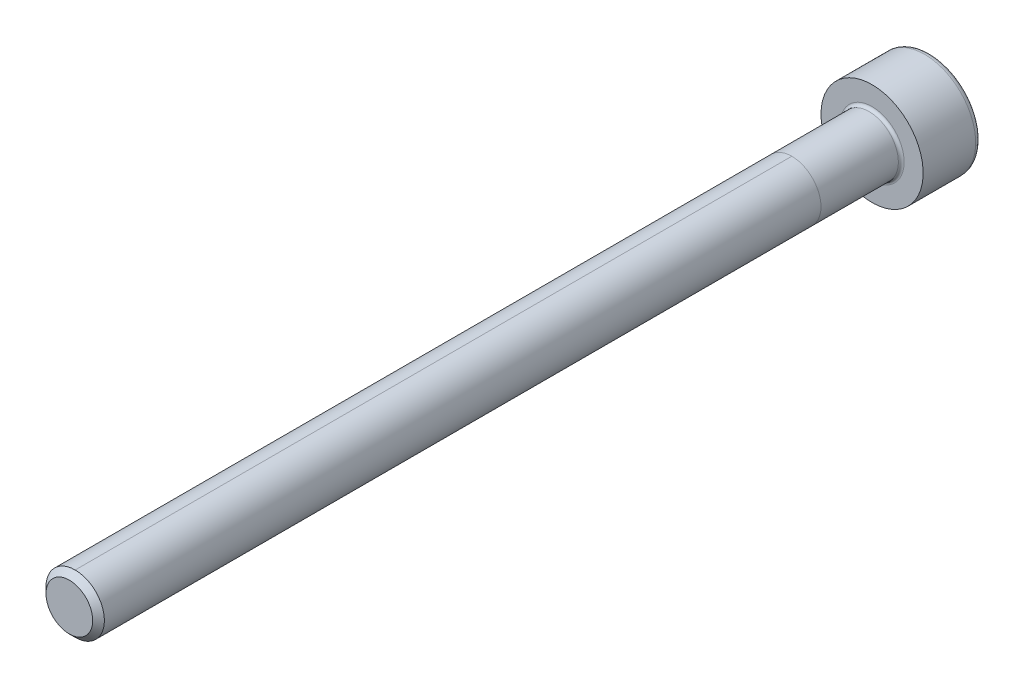
ISO-10303-21;
HEADER;
FILE_DESCRIPTION(('STEP AP214'),'2;1');
FILE_NAME('part.step','',(''),(''),'','','');
FILE_SCHEMA(('AUTOMOTIVE_DESIGN { 1 0 10303 214 1 1 1 1 }'));
ENDSEC;
DATA;
#1=APPLICATION_CONTEXT('core data for automotive mechanical design processes');
#2=APPLICATION_PROTOCOL_DEFINITION('international standard','automotive_design',2000,#1);
#3=PRODUCT_CONTEXT('',#1,'mechanical');
#4=PRODUCT('Part','Part','',(#3));
#5=PRODUCT_RELATED_PRODUCT_CATEGORY('part','',(#4));
#6=PRODUCT_DEFINITION_FORMATION('','',#4);
#7=PRODUCT_DEFINITION_CONTEXT('part definition',#1,'design');
#8=PRODUCT_DEFINITION('design','',#6,#7);
#9=PRODUCT_DEFINITION_SHAPE('','',#8);
#10=(LENGTH_UNIT() NAMED_UNIT(*) SI_UNIT(.MILLI.,.METRE.));
#11=(NAMED_UNIT(*) PLANE_ANGLE_UNIT() SI_UNIT($,.RADIAN.));
#12=(NAMED_UNIT(*) SI_UNIT($,.STERADIAN.) SOLID_ANGLE_UNIT());
#13=UNCERTAINTY_MEASURE_WITH_UNIT(LENGTH_MEASURE(1.E-05),#10,'distance_accuracy_value','');
#14=(GEOMETRIC_REPRESENTATION_CONTEXT(3) GLOBAL_UNCERTAINTY_ASSIGNED_CONTEXT((#13)) GLOBAL_UNIT_ASSIGNED_CONTEXT((#10,
#11,#12)) REPRESENTATION_CONTEXT('',''));
#15=CARTESIAN_POINT('',(0.,0.,0.));
#16=DIRECTION('',(0.,0.,1.));
#17=DIRECTION('',(1.,0.,0.));
#18=AXIS2_PLACEMENT_3D('',#15,#16,#17);
#19=CARTESIAN_POINT('',(0.,0.,55.));
#20=DIRECTION('',(0.,0.,-1.));
#21=DIRECTION('',(-1.,0.,0.));
#22=AXIS2_PLACEMENT_3D('',#19,#20,#21);
#23=CYLINDRICAL_SURFACE('',#22,2.);
#24=DIRECTION('',(0.,0.,-1.));
#25=VECTOR('',#24,1.);
#26=CARTESIAN_POINT('',(0.,2.,55.));
#27=LINE('',#26,#25);
#28=CARTESIAN_POINT('',(0.,2.,54.6));
#29=VERTEX_POINT('',#28);
#30=CARTESIAN_POINT('',(0.,2.,5.5));
#31=VERTEX_POINT('',#30);
#32=EDGE_CURVE('E58',#29,#31,#27,.T.);
#33=ORIENTED_EDGE('',*,*,#32,.F.);
#34=CARTESIAN_POINT('',(0.,0.,54.6));
#35=DIRECTION('',(0.,0.,1.));
#36=DIRECTION('',(1.,0.,0.));
#37=AXIS2_PLACEMENT_3D('',#34,#35,#36);
#38=CIRCLE('',#37,2.);
#39=CARTESIAN_POINT('',(0.,-2.,54.6));
#40=VERTEX_POINT('',#39);
#41=EDGE_CURVE('E192',#29,#40,#38,.F.);
#42=ORIENTED_EDGE('',*,*,#41,.T.);
#43=DIRECTION('',(0.,0.,-1.));
#44=VECTOR('',#43,1.);
#45=CARTESIAN_POINT('',(0.,-2.00000000000001,55.));
#46=LINE('',#45,#44);
#47=CARTESIAN_POINT('',(0.,-2.00000000000001,5.5));
#48=VERTEX_POINT('',#47);
#49=EDGE_CURVE('E195',#40,#48,#46,.T.);
#50=ORIENTED_EDGE('',*,*,#49,.T.);
#51=CARTESIAN_POINT('',(0.,0.,5.5));
#52=DIRECTION('',(0.,0.,1.));
#53=DIRECTION('',(0.,-1.,0.));
#54=AXIS2_PLACEMENT_3D('',#51,#52,#53);
#55=CIRCLE('',#54,2.);
#56=EDGE_CURVE('E64',#48,#31,#55,.T.);
#57=ORIENTED_EDGE('',*,*,#56,.T.);
#58=EDGE_LOOP('',(#33,#42,#50,#57));
#59=FACE_BOUND('',#58,.T.);
#60=ADVANCED_FACE('F43',(#59),#23,.T.);
#61=CARTESIAN_POINT('',(0.,0.,0.199999999999999));
#62=DIRECTION('',(0.,0.,-1.));
#63=DIRECTION('',(-1.,0.,0.));
#64=AXIS2_PLACEMENT_3D('',#61,#62,#63);
#65=CIRCLE('',#64,2.);
#66=CARTESIAN_POINT('',(-2.,0.,0.199999999999999));
#67=VERTEX_POINT('',#66);
#68=EDGE_CURVE('E12',#67,#67,#65,.F.);
#69=ORIENTED_EDGE('',*,*,#68,.T.);
#70=EDGE_LOOP('',(#69));
#71=FACE_BOUND('',#70,.T.);
#72=ORIENTED_EDGE('',*,*,#56,.F.);
#73=EDGE_CURVE('E217',#31,#48,#55,.T.);
#74=ORIENTED_EDGE('',*,*,#73,.F.);
#75=EDGE_LOOP('',(#72,#74));
#76=FACE_BOUND('',#75,.T.);
#77=ADVANCED_FACE('F235',(#71,#76),#23,.T.);
#78=EDGE_CURVE('E193',#40,#29,#38,.F.);
#79=ORIENTED_EDGE('',*,*,#78,.T.);
#80=ORIENTED_EDGE('',*,*,#32,.T.);
#81=ORIENTED_EDGE('',*,*,#73,.T.);
#82=ORIENTED_EDGE('',*,*,#49,.F.);
#83=EDGE_LOOP('',(#79,#80,#81,#82));
#84=FACE_BOUND('',#83,.T.);
#85=ADVANCED_FACE('F238',(#84),#23,.T.);
#86=CARTESIAN_POINT('',(0.,0.,55.));
#87=DIRECTION('',(0.,0.,1.));
#88=DIRECTION('',(1.,0.,0.));
#89=AXIS2_PLACEMENT_3D('',#86,#87,#88);
#90=PLANE('',#89);
#91=CARTESIAN_POINT('',(0.,0.,55.));
#92=DIRECTION('',(0.,0.,1.));
#93=DIRECTION('',(1.,0.,0.));
#94=AXIS2_PLACEMENT_3D('',#91,#92,#93);
#95=CIRCLE('',#94,1.60000000000002);
#96=CARTESIAN_POINT('',(1.60000000000002,0.,55.));
#97=VERTEX_POINT('',#96);
#98=EDGE_CURVE('E189',#97,#97,#95,.T.);
#99=ORIENTED_EDGE('',*,*,#98,.T.);
#100=EDGE_LOOP('',(#99));
#101=FACE_BOUND('',#100,.T.);
#102=ADVANCED_FACE('F246',(#101),#90,.T.);
#103=CARTESIAN_POINT('',(0.,0.,0.));
#104=DIRECTION('',(0.,0.,-1.));
#105=DIRECTION('',(-1.,0.,0.));
#106=AXIS2_PLACEMENT_3D('',#103,#104,#105);
#107=PLANE('',#106);
#108=CARTESIAN_POINT('',(0.,0.,0.));
#109=DIRECTION('',(0.,0.,-1.));
#110=DIRECTION('',(-1.,0.,0.));
#111=AXIS2_PLACEMENT_3D('',#108,#109,#110);
#112=CIRCLE('',#111,2.2);
#113=CARTESIAN_POINT('',(-2.2,0.,0.));
#114=VERTEX_POINT('',#113);
#115=EDGE_CURVE('E51',#114,#114,#112,.T.);
#116=ORIENTED_EDGE('',*,*,#115,.T.);
#117=EDGE_LOOP('',(#116));
#118=FACE_BOUND('',#117,.T.);
#119=CARTESIAN_POINT('',(0.,0.,0.));
#120=DIRECTION('',(0.,0.,-1.));
#121=DIRECTION('',(-1.,0.,0.));
#122=AXIS2_PLACEMENT_3D('',#119,#120,#121);
#123=CIRCLE('',#122,3.5);
#124=CARTESIAN_POINT('',(-3.5,0.,0.));
#125=VERTEX_POINT('',#124);
#126=EDGE_CURVE('E179',#125,#125,#123,.T.);
#127=ORIENTED_EDGE('',*,*,#126,.F.);
#128=EDGE_LOOP('',(#127));
#129=FACE_BOUND('',#128,.T.);
#130=ADVANCED_FACE('F224',(#118,#129),#107,.F.);
#131=CARTESIAN_POINT('',(0.,0.,-4.));
#132=DIRECTION('',(0.,0.,1.));
#133=DIRECTION('',(1.,0.,0.));
#134=AXIS2_PLACEMENT_3D('',#131,#132,#133);
#135=CYLINDRICAL_SURFACE('',#134,3.5);
#136=CARTESIAN_POINT('',(0.,0.,-3.6));
#137=DIRECTION('',(0.,0.,-1.));
#138=DIRECTION('',(-1.,0.,0.));
#139=AXIS2_PLACEMENT_3D('',#136,#137,#138);
#140=CIRCLE('',#139,3.5);
#141=CARTESIAN_POINT('',(-3.5,0.,-3.6));
#142=VERTEX_POINT('',#141);
#143=EDGE_CURVE('E186',#142,#142,#140,.F.);
#144=ORIENTED_EDGE('',*,*,#143,.T.);
#145=EDGE_LOOP('',(#144));
#146=FACE_BOUND('',#145,.T.);
#147=ORIENTED_EDGE('',*,*,#126,.T.);
#148=EDGE_LOOP('',(#147));
#149=FACE_BOUND('',#148,.T.);
#150=ADVANCED_FACE('F282',(#146,#149),#135,.T.);
#151=CARTESIAN_POINT('',(0.,0.,-4.));
#152=DIRECTION('',(0.,0.,-1.));
#153=DIRECTION('',(-1.,0.,0.));
#154=AXIS2_PLACEMENT_3D('',#151,#152,#153);
#155=PLANE('',#154);
#156=DIRECTION('',(0.499999999999998,-0.866025403784439,0.));
#157=VECTOR('',#156,1.);
#158=CARTESIAN_POINT('',(0.866025403784439,1.5,-4.));
#159=LINE('',#158,#157);
#160=CARTESIAN_POINT('',(0.866025403784439,1.5,-4.));
#161=VERTEX_POINT('',#160);
#162=CARTESIAN_POINT('',(1.73205080756888,0.,-4.));
#163=VERTEX_POINT('',#162);
#164=EDGE_CURVE('E122',#161,#163,#159,.T.);
#165=ORIENTED_EDGE('',*,*,#164,.F.);
#166=DIRECTION('',(1.,0.,0.));
#167=VECTOR('',#166,1.);
#168=CARTESIAN_POINT('',(-0.866025403784446,1.5,-4.));
#169=LINE('',#168,#167);
#170=CARTESIAN_POINT('',(-0.866025403784446,1.5,-4.));
#171=VERTEX_POINT('',#170);
#172=EDGE_CURVE('E176',#171,#161,#169,.T.);
#173=ORIENTED_EDGE('',*,*,#172,.F.);
#174=DIRECTION('',(0.5,0.866025403784439,0.));
#175=VECTOR('',#174,1.);
#176=CARTESIAN_POINT('',(-1.73205080756888,0.,-4.));
#177=LINE('',#176,#175);
#178=CARTESIAN_POINT('',(-1.73205080756888,0.,-4.));
#179=VERTEX_POINT('',#178);
#180=EDGE_CURVE('E173',#179,#171,#177,.T.);
#181=ORIENTED_EDGE('',*,*,#180,.F.);
#182=DIRECTION('',(-0.5,0.866025403784439,0.));
#183=VECTOR('',#182,1.);
#184=CARTESIAN_POINT('',(-0.866025403784443,-1.5,-4.));
#185=LINE('',#184,#183);
#186=CARTESIAN_POINT('',(-0.866025403784443,-1.5,-4.));
#187=VERTEX_POINT('',#186);
#188=EDGE_CURVE('E170',#187,#179,#185,.T.);
#189=ORIENTED_EDGE('',*,*,#188,.F.);
#190=DIRECTION('',(-1.,0.,0.));
#191=VECTOR('',#190,1.);
#192=CARTESIAN_POINT('',(0.866025403784436,-1.5,-4.));
#193=LINE('',#192,#191);
#194=CARTESIAN_POINT('',(0.866025403784436,-1.5,-4.));
#195=VERTEX_POINT('',#194);
#196=EDGE_CURVE('E167',#195,#187,#193,.T.);
#197=ORIENTED_EDGE('',*,*,#196,.F.);
#198=DIRECTION('',(-0.500000000000001,-0.866025403784438,0.));
#199=VECTOR('',#198,1.);
#200=CARTESIAN_POINT('',(1.73205080756888,0.,-4.));
#201=LINE('',#200,#199);
#202=EDGE_CURVE('E164',#163,#195,#201,.T.);
#203=ORIENTED_EDGE('',*,*,#202,.F.);
#204=EDGE_LOOP('',(#165,#173,#181,#189,#197,#203));
#205=FACE_BOUND('',#204,.T.);
#206=CARTESIAN_POINT('',(0.,0.,-4.));
#207=DIRECTION('',(0.,0.,-1.));
#208=DIRECTION('',(-1.,0.,0.));
#209=AXIS2_PLACEMENT_3D('',#206,#207,#208);
#210=CIRCLE('',#209,3.1);
#211=CARTESIAN_POINT('',(-3.1,0.,-4.));
#212=VERTEX_POINT('',#211);
#213=EDGE_CURVE('E182',#212,#212,#210,.T.);
#214=ORIENTED_EDGE('',*,*,#213,.T.);
#215=EDGE_LOOP('',(#214));
#216=FACE_BOUND('',#215,.T.);
#217=ADVANCED_FACE('F277',(#205,#216),#155,.T.);
#218=CARTESIAN_POINT('',(0.,0.,-3.6));
#219=DIRECTION('',(0.,0.,-1.));
#220=DIRECTION('',(-1.,0.,0.));
#221=AXIS2_PLACEMENT_3D('',#218,#219,#220);
#222=TOROIDAL_SURFACE('',#221,3.1,0.4);
#223=ORIENTED_EDGE('',*,*,#143,.F.);
#224=EDGE_LOOP('',(#223));
#225=FACE_BOUND('',#224,.T.);
#226=ORIENTED_EDGE('',*,*,#213,.F.);
#227=EDGE_LOOP('',(#226));
#228=FACE_BOUND('',#227,.T.);
#229=ADVANCED_FACE('F268',(#225,#228),#222,.T.);
#230=CARTESIAN_POINT('',(0.,0.,55.));
#231=DIRECTION('',(0.,0.,-1.));
#232=DIRECTION('',(-1.,0.,0.));
#233=AXIS2_PLACEMENT_3D('',#230,#231,#232);
#234=CONICAL_SURFACE('',#233,1.60000000000002,0.785398163397448);
#235=ORIENTED_EDGE('',*,*,#78,.F.);
#236=ORIENTED_EDGE('',*,*,#41,.F.);
#237=EDGE_LOOP('',(#235,#236));
#238=FACE_BOUND('',#237,.T.);
#239=ORIENTED_EDGE('',*,*,#98,.F.);
#240=EDGE_LOOP('',(#239));
#241=FACE_BOUND('',#240,.T.);
#242=ADVANCED_FACE('F255',(#238,#241),#234,.T.);
#243=CARTESIAN_POINT('',(0.866025403784439,1.5,-2.66666666666667));
#244=DIRECTION('',(0.866025403784439,0.499999999999998,0.));
#245=DIRECTION('',(-0.499999999999999,0.86602540378444,0.));
#246=AXIS2_PLACEMENT_3D('',#243,#244,#245);
#247=PLANE('',#246);
#248=ORIENTED_EDGE('',*,*,#164,.T.);
#249=DIRECTION('',(0.,0.,-1.));
#250=VECTOR('',#249,1.);
#251=CARTESIAN_POINT('',(1.73205080756888,0.,-2.66666666666667));
#252=LINE('',#251,#250);
#253=CARTESIAN_POINT('',(1.73205080756887,0.,-2.66666666666667));
#254=VERTEX_POINT('',#253);
#255=EDGE_CURVE('E200',#254,#163,#252,.T.);
#256=ORIENTED_EDGE('',*,*,#255,.F.);
#257=DIRECTION('',(-0.499999999999998,0.86602540378444,0.));
#258=VECTOR('',#257,1.);
#259=CARTESIAN_POINT('',(1.73205080756887,0.,-2.66666666666667));
#260=LINE('',#259,#258);
#261=CARTESIAN_POINT('',(0.866025403784439,1.5,-2.66666666666667));
#262=VERTEX_POINT('',#261);
#263=EDGE_CURVE('E117',#262,#254,#260,.F.);
#264=ORIENTED_EDGE('',*,*,#263,.F.);
#265=DIRECTION('',(0.,0.,-1.));
#266=VECTOR('',#265,1.);
#267=CARTESIAN_POINT('',(0.866025403784439,1.5,-2.66666666666667));
#268=LINE('',#267,#266);
#269=EDGE_CURVE('E183',#262,#161,#268,.T.);
#270=ORIENTED_EDGE('',*,*,#269,.T.);
#271=EDGE_LOOP('',(#248,#256,#264,#270));
#272=FACE_BOUND('',#271,.T.);
#273=ADVANCED_FACE('F267',(#272),#247,.F.);
#274=CARTESIAN_POINT('',(-0.866025403784446,1.5,-2.66666666666667));
#275=DIRECTION('',(0.,1.,0.));
#276=DIRECTION('',(0.,0.,1.));
#277=AXIS2_PLACEMENT_3D('',#274,#275,#276);
#278=PLANE('',#277);
#279=ORIENTED_EDGE('',*,*,#172,.T.);
#280=ORIENTED_EDGE('',*,*,#269,.F.);
#281=DIRECTION('',(1.,0.,0.));
#282=VECTOR('',#281,1.);
#283=CARTESIAN_POINT('',(0.,1.5,-2.66666666666667));
#284=LINE('',#283,#282);
#285=CARTESIAN_POINT('',(-0.866025403784447,1.5,-2.66666666666667));
#286=VERTEX_POINT('',#285);
#287=EDGE_CURVE('E131',#286,#262,#284,.T.);
#288=ORIENTED_EDGE('',*,*,#287,.F.);
#289=DIRECTION('',(0.,0.,-1.));
#290=VECTOR('',#289,1.);
#291=CARTESIAN_POINT('',(-0.866025403784446,1.5,-2.66666666666667));
#292=LINE('',#291,#290);
#293=EDGE_CURVE('E196',#286,#171,#292,.T.);
#294=ORIENTED_EDGE('',*,*,#293,.T.);
#295=EDGE_LOOP('',(#279,#280,#288,#294));
#296=FACE_BOUND('',#295,.T.);
#297=ADVANCED_FACE('F274',(#296),#278,.F.);
#298=CARTESIAN_POINT('',(-1.73205080756888,0.,-2.66666666666667));
#299=DIRECTION('',(-0.866025403784439,0.5,0.));
#300=DIRECTION('',(-0.5,-0.866025403784439,0.));
#301=AXIS2_PLACEMENT_3D('',#298,#299,#300);
#302=PLANE('',#301);
#303=ORIENTED_EDGE('',*,*,#180,.T.);
#304=ORIENTED_EDGE('',*,*,#293,.F.);
#305=DIRECTION('',(-0.5,-0.866025403784439,0.));
#306=VECTOR('',#305,1.);
#307=CARTESIAN_POINT('',(-0.866025403784447,1.5,-2.66666666666667));
#308=LINE('',#307,#306);
#309=CARTESIAN_POINT('',(-1.73205080756888,0.,-2.66666666666667));
#310=VERTEX_POINT('',#309);
#311=EDGE_CURVE('E139',#310,#286,#308,.F.);
#312=ORIENTED_EDGE('',*,*,#311,.F.);
#313=DIRECTION('',(0.,0.,-1.));
#314=VECTOR('',#313,1.);
#315=CARTESIAN_POINT('',(-1.73205080756888,0.,-2.66666666666667));
#316=LINE('',#315,#314);
#317=EDGE_CURVE('E198',#310,#179,#316,.T.);
#318=ORIENTED_EDGE('',*,*,#317,.T.);
#319=EDGE_LOOP('',(#303,#304,#312,#318));
#320=FACE_BOUND('',#319,.T.);
#321=ADVANCED_FACE('F310',(#320),#302,.F.);
#322=CARTESIAN_POINT('',(-0.866025403784443,-1.5,-2.66666666666667));
#323=DIRECTION('',(-0.866025403784439,-0.5,0.));
#324=DIRECTION('',(0.5,-0.866025403784439,0.));
#325=AXIS2_PLACEMENT_3D('',#322,#323,#324);
#326=PLANE('',#325);
#327=ORIENTED_EDGE('',*,*,#188,.T.);
#328=ORIENTED_EDGE('',*,*,#317,.F.);
#329=DIRECTION('',(0.5,-0.866025403784439,0.));
#330=VECTOR('',#329,1.);
#331=CARTESIAN_POINT('',(-1.73205080756888,0.,-2.66666666666667));
#332=LINE('',#331,#330);
#333=CARTESIAN_POINT('',(-0.866025403784443,-1.5,-2.66666666666667));
#334=VERTEX_POINT('',#333);
#335=EDGE_CURVE('E147',#334,#310,#332,.F.);
#336=ORIENTED_EDGE('',*,*,#335,.F.);
#337=DIRECTION('',(0.,0.,-1.));
#338=VECTOR('',#337,1.);
#339=CARTESIAN_POINT('',(-0.866025403784443,-1.5,-2.66666666666667));
#340=LINE('',#339,#338);
#341=EDGE_CURVE('E205',#334,#187,#340,.T.);
#342=ORIENTED_EDGE('',*,*,#341,.T.);
#343=EDGE_LOOP('',(#327,#328,#336,#342));
#344=FACE_BOUND('',#343,.T.);
#345=ADVANCED_FACE('F306',(#344),#326,.F.);
#346=CARTESIAN_POINT('',(0.866025403784436,-1.5,-2.66666666666667));
#347=DIRECTION('',(0.,-1.,0.));
#348=DIRECTION('',(0.,0.,-1.));
#349=AXIS2_PLACEMENT_3D('',#346,#347,#348);
#350=PLANE('',#349);
#351=ORIENTED_EDGE('',*,*,#196,.T.);
#352=ORIENTED_EDGE('',*,*,#341,.F.);
#353=DIRECTION('',(1.,0.,0.));
#354=VECTOR('',#353,1.);
#355=CARTESIAN_POINT('',(0.,-1.5,-2.66666666666667));
#356=LINE('',#355,#354);
#357=CARTESIAN_POINT('',(0.866025403784436,-1.5,-2.66666666666667));
#358=VERTEX_POINT('',#357);
#359=EDGE_CURVE('E154',#358,#334,#356,.F.);
#360=ORIENTED_EDGE('',*,*,#359,.F.);
#361=DIRECTION('',(0.,0.,-1.));
#362=VECTOR('',#361,1.);
#363=CARTESIAN_POINT('',(0.866025403784436,-1.5,-2.66666666666667));
#364=LINE('',#363,#362);
#365=EDGE_CURVE('E203',#358,#195,#364,.T.);
#366=ORIENTED_EDGE('',*,*,#365,.T.);
#367=EDGE_LOOP('',(#351,#352,#360,#366));
#368=FACE_BOUND('',#367,.T.);
#369=ADVANCED_FACE('F302',(#368),#350,.F.);
#370=CARTESIAN_POINT('',(1.73205080756888,0.,-2.66666666666667));
#371=DIRECTION('',(0.866025403784438,-0.500000000000001,0.));
#372=DIRECTION('',(0.500000000000001,0.866025403784438,0.));
#373=AXIS2_PLACEMENT_3D('',#370,#371,#372);
#374=PLANE('',#373);
#375=ORIENTED_EDGE('',*,*,#202,.T.);
#376=ORIENTED_EDGE('',*,*,#365,.F.);
#377=DIRECTION('',(0.500000000000001,0.866025403784438,0.));
#378=VECTOR('',#377,1.);
#379=CARTESIAN_POINT('',(0.866025403784436,-1.5,-2.66666666666667));
#380=LINE('',#379,#378);
#381=EDGE_CURVE('E159',#254,#358,#380,.F.);
#382=ORIENTED_EDGE('',*,*,#381,.F.);
#383=ORIENTED_EDGE('',*,*,#255,.T.);
#384=EDGE_LOOP('',(#375,#376,#382,#383));
#385=FACE_BOUND('',#384,.T.);
#386=ADVANCED_FACE('F299',(#385),#374,.F.);
#387=CARTESIAN_POINT('',(-0.583171863311223,-0.336694432266549,-1.89390618149934));
#388=DIRECTION('',(0.290126882702444,0.167504833827402,0.942214690279141));
#389=DIRECTION('',(0.955717783517744,0.,-0.294284757111084));
#390=AXIS2_PLACEMENT_3D('',#387,#388,#389);
#391=PLANE('',#390);
#392=DIRECTION('',(-0.477858891758872,-0.827675879374924,0.294284757111084));
#393=VECTOR('',#392,1.);
#394=CARTESIAN_POINT('',(0.866025403784439,1.5,-2.66666666666667));
#395=LINE('',#394,#393);
#396=CARTESIAN_POINT('',(0.,0.,-2.13333333333333));
#397=VERTEX_POINT('',#396);
#398=EDGE_CURVE('E114',#262,#397,#395,.T.);
#399=ORIENTED_EDGE('',*,*,#398,.F.);
#400=ORIENTED_EDGE('',*,*,#263,.T.);
#401=DIRECTION('',(-0.955717783517745,0.,0.294284757111084));
#402=VECTOR('',#401,1.);
#403=CARTESIAN_POINT('',(1.73205080756888,0.,-2.66666666666667));
#404=LINE('',#403,#402);
#405=EDGE_CURVE('E111',#254,#397,#404,.T.);
#406=ORIENTED_EDGE('',*,*,#405,.T.);
#407=EDGE_LOOP('',(#399,#400,#406));
#408=FACE_BOUND('',#407,.T.);
#409=ADVANCED_FACE('F113',(#408),#391,.F.);
#410=CARTESIAN_POINT('',(-0.583171863311223,0.336694432266551,-1.89390618149934));
#411=DIRECTION('',(0.290126882702444,-0.167504833827403,0.94221469027914));
#412=DIRECTION('',(0.955717783517745,0.,-0.294284757111084));
#413=AXIS2_PLACEMENT_3D('',#410,#411,#412);
#414=PLANE('',#413);
#415=ORIENTED_EDGE('',*,*,#405,.F.);
#416=ORIENTED_EDGE('',*,*,#381,.T.);
#417=DIRECTION('',(-0.477858891758872,0.827675879374924,0.294284757111084));
#418=VECTOR('',#417,1.);
#419=CARTESIAN_POINT('',(0.866025403784436,-1.5,-2.66666666666667));
#420=LINE('',#419,#418);
#421=EDGE_CURVE('E152',#358,#397,#420,.T.);
#422=ORIENTED_EDGE('',*,*,#421,.T.);
#423=EDGE_LOOP('',(#415,#416,#422));
#424=FACE_BOUND('',#423,.T.);
#425=ADVANCED_FACE('F157',(#424),#414,.F.);
#426=CARTESIAN_POINT('',(0.,-0.673388864533099,-1.89390618149934));
#427=DIRECTION('',(0.,0.335009667654805,0.942214690279141));
#428=DIRECTION('',(0.,-0.942214690279141,0.335009667654805));
#429=AXIS2_PLACEMENT_3D('',#426,#427,#428);
#430=PLANE('',#429);
#431=DIRECTION('',(0.477858891758875,-0.827675879374922,0.294284757111083));
#432=VECTOR('',#431,1.);
#433=CARTESIAN_POINT('',(-0.866025403784446,1.5,-2.66666666666667));
#434=LINE('',#433,#432);
#435=EDGE_CURVE('E128',#286,#397,#434,.T.);
#436=ORIENTED_EDGE('',*,*,#435,.F.);
#437=ORIENTED_EDGE('',*,*,#287,.T.);
#438=ORIENTED_EDGE('',*,*,#398,.T.);
#439=EDGE_LOOP('',(#436,#437,#438));
#440=FACE_BOUND('',#439,.T.);
#441=ADVANCED_FACE('F127',(#440),#430,.F.);
#442=CARTESIAN_POINT('',(0.58317186331122,-0.336694432266548,-1.89390618149934));
#443=DIRECTION('',(-0.290126882702442,0.167504833827402,0.942214690279141));
#444=DIRECTION('',(0.955717783517745,0.,0.294284757111083));
#445=AXIS2_PLACEMENT_3D('',#442,#443,#444);
#446=PLANE('',#445);
#447=DIRECTION('',(0.955717783517745,0.,0.294284757111083));
#448=VECTOR('',#447,1.);
#449=CARTESIAN_POINT('',(-1.73205080756888,0.,-2.66666666666667));
#450=LINE('',#449,#448);
#451=EDGE_CURVE('E136',#310,#397,#450,.T.);
#452=ORIENTED_EDGE('',*,*,#451,.F.);
#453=ORIENTED_EDGE('',*,*,#311,.T.);
#454=ORIENTED_EDGE('',*,*,#435,.T.);
#455=EDGE_LOOP('',(#452,#453,#454));
#456=FACE_BOUND('',#455,.T.);
#457=ADVANCED_FACE('F135',(#456),#446,.F.);
#458=CARTESIAN_POINT('',(0.583171863311222,0.336694432266549,-1.89390618149934));
#459=DIRECTION('',(-0.290126882702443,-0.167504833827402,0.942214690279141));
#460=DIRECTION('',(0.955717783517745,0.,0.294284757111083));
#461=AXIS2_PLACEMENT_3D('',#458,#459,#460);
#462=PLANE('',#461);
#463=DIRECTION('',(0.477858891758875,0.827675879374922,0.294284757111084));
#464=VECTOR('',#463,1.);
#465=CARTESIAN_POINT('',(-0.866025403784443,-1.5,-2.66666666666667));
#466=LINE('',#465,#464);
#467=EDGE_CURVE('E144',#334,#397,#466,.T.);
#468=ORIENTED_EDGE('',*,*,#467,.F.);
#469=ORIENTED_EDGE('',*,*,#335,.T.);
#470=ORIENTED_EDGE('',*,*,#451,.T.);
#471=EDGE_LOOP('',(#468,#469,#470));
#472=FACE_BOUND('',#471,.T.);
#473=ADVANCED_FACE('F143',(#472),#462,.F.);
#474=CARTESIAN_POINT('',(0.,0.6733888645331,-1.89390618149934));
#475=DIRECTION('',(0.,-0.335009667654806,0.94221469027914));
#476=DIRECTION('',(0.,-0.94221469027914,-0.335009667654806));
#477=AXIS2_PLACEMENT_3D('',#474,#475,#476);
#478=PLANE('',#477);
#479=ORIENTED_EDGE('',*,*,#421,.F.);
#480=ORIENTED_EDGE('',*,*,#359,.T.);
#481=ORIENTED_EDGE('',*,*,#467,.T.);
#482=EDGE_LOOP('',(#479,#480,#481));
#483=FACE_BOUND('',#482,.T.);
#484=ADVANCED_FACE('F151',(#483),#478,.F.);
#485=CARTESIAN_POINT('',(0.,0.,0.199999999999999));
#486=DIRECTION('',(0.,0.,-1.));
#487=DIRECTION('',(-1.,0.,0.));
#488=AXIS2_PLACEMENT_3D('',#485,#486,#487);
#489=TOROIDAL_SURFACE('',#488,2.2,0.2);
#490=ORIENTED_EDGE('',*,*,#68,.F.);
#491=EDGE_LOOP('',(#490));
#492=FACE_BOUND('',#491,.T.);
#493=ORIENTED_EDGE('',*,*,#115,.F.);
#494=EDGE_LOOP('',(#493));
#495=FACE_BOUND('',#494,.T.);
#496=ADVANCED_FACE('F45',(#492,#495),#489,.F.);
#497=CLOSED_SHELL('',(#60,#77,#85,#102,#130,#150,#217,#229,#242,#273,#297,#321,#345,#369,#386,
#409,#425,#441,#457,#473,#484,#496));
#498=MANIFOLD_SOLID_BREP('B2',#497);
#499=ADVANCED_BREP_SHAPE_REPRESENTATION('',(#18,#498),#14);
#500=SHAPE_DEFINITION_REPRESENTATION(#9,#499);
ENDSEC;
END-ISO-10303-21;
